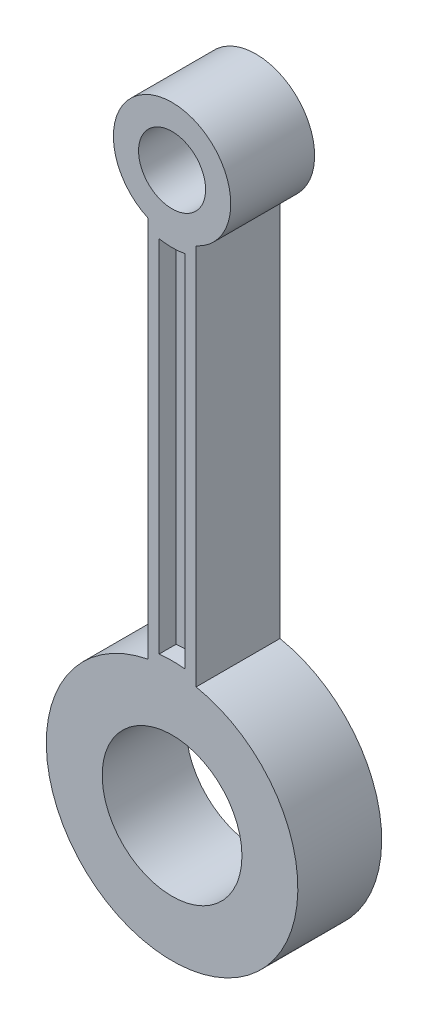
ISO-10303-21;
HEADER;
FILE_DESCRIPTION(('STEP AP214'),'2;1');
FILE_NAME('part.step','',(''),(''),'','','');
FILE_SCHEMA(('AUTOMOTIVE_DESIGN { 1 0 10303 214 1 1 1 1 }'));
ENDSEC;
DATA;
#1=APPLICATION_CONTEXT('core data for automotive mechanical design processes');
#2=APPLICATION_PROTOCOL_DEFINITION('international standard','automotive_design',2000,#1);
#3=PRODUCT_CONTEXT('',#1,'mechanical');
#4=PRODUCT('Part','Part','',(#3));
#5=PRODUCT_RELATED_PRODUCT_CATEGORY('part','',(#4));
#6=PRODUCT_DEFINITION_FORMATION('','',#4);
#7=PRODUCT_DEFINITION_CONTEXT('part definition',#1,'design');
#8=PRODUCT_DEFINITION('design','',#6,#7);
#9=PRODUCT_DEFINITION_SHAPE('','',#8);
#10=(LENGTH_UNIT() NAMED_UNIT(*) SI_UNIT(.MILLI.,.METRE.));
#11=(NAMED_UNIT(*) PLANE_ANGLE_UNIT() SI_UNIT($,.RADIAN.));
#12=(NAMED_UNIT(*) SI_UNIT($,.STERADIAN.) SOLID_ANGLE_UNIT());
#13=UNCERTAINTY_MEASURE_WITH_UNIT(LENGTH_MEASURE(1.E-05),#10,'distance_accuracy_value','');
#14=(GEOMETRIC_REPRESENTATION_CONTEXT(3) GLOBAL_UNCERTAINTY_ASSIGNED_CONTEXT((#13)) GLOBAL_UNIT_ASSIGNED_CONTEXT((#10,
#11,#12)) REPRESENTATION_CONTEXT('',''));
#15=CARTESIAN_POINT('',(0.,0.,0.));
#16=DIRECTION('',(0.,0.,1.));
#17=DIRECTION('',(1.,0.,0.));
#18=AXIS2_PLACEMENT_3D('',#15,#16,#17);
#19=CARTESIAN_POINT('',(-2.28940693972808,-31.4618055569592,7.5));
#20=DIRECTION('',(0.,0.,-1.));
#21=DIRECTION('',(-1.,0.,0.));
#22=AXIS2_PLACEMENT_3D('',#19,#20,#21);
#23=CYLINDRICAL_SURFACE('',#22,24.);
#24=DIRECTION('',(0.,0.,-1.));
#25=VECTOR('',#24,1.);
#26=CARTESIAN_POINT('',(-4.5894069397281,-7.57226809806313,7.5));
#27=LINE('',#26,#25);
#28=CARTESIAN_POINT('',(-4.5894069397281,-7.57226809806313,-4.5));
#29=VERTEX_POINT('',#28);
#30=CARTESIAN_POINT('',(-4.5894069397281,-7.57226809806313,-7.5));
#31=VERTEX_POINT('',#30);
#32=EDGE_CURVE('E137',#29,#31,#27,.T.);
#33=ORIENTED_EDGE('',*,*,#32,.F.);
#34=CARTESIAN_POINT('',(-2.28940693972808,-31.4618055569592,-4.5));
#35=DIRECTION('',(0.,0.,-1.));
#36=DIRECTION('',(1.,0.,0.));
#37=AXIS2_PLACEMENT_3D('',#34,#35,#36);
#38=CIRCLE('',#37,24.);
#39=CARTESIAN_POINT('',(0.0105930602718988,-7.57226809806313,-4.5));
#40=VERTEX_POINT('',#39);
#41=EDGE_CURVE('E155',#29,#40,#38,.T.);
#42=ORIENTED_EDGE('',*,*,#41,.T.);
#43=DIRECTION('',(0.,0.,-1.));
#44=VECTOR('',#43,1.);
#45=CARTESIAN_POINT('',(0.0105930602718988,-7.57226809806313,7.5));
#46=LINE('',#45,#44);
#47=CARTESIAN_POINT('',(0.0105930602718988,-7.57226809806313,-7.5));
#48=VERTEX_POINT('',#47);
#49=EDGE_CURVE('E187',#40,#48,#46,.T.);
#50=ORIENTED_EDGE('',*,*,#49,.T.);
#51=CARTESIAN_POINT('',(-2.28940693972808,-31.4618055569592,-7.5));
#52=DIRECTION('',(0.,0.,-1.));
#53=DIRECTION('',(1.,0.,0.));
#54=AXIS2_PLACEMENT_3D('',#51,#52,#53);
#55=CIRCLE('',#54,24.);
#56=EDGE_CURVE('E147',#31,#48,#55,.T.);
#57=ORIENTED_EDGE('',*,*,#56,.F.);
#58=EDGE_LOOP('',(#33,#42,#50,#57));
#59=FACE_BOUND('',#58,.T.);
#60=ADVANCED_FACE('F36',(#59),#23,.T.);
#61=CARTESIAN_POINT('',(0.0105930602718988,-7.57226809806313,7.5));
#62=DIRECTION('',(-1.,0.,0.));
#63=DIRECTION('',(0.,-1.,0.));
#64=AXIS2_PLACEMENT_3D('',#61,#62,#63);
#65=PLANE('',#64);
#66=ORIENTED_EDGE('',*,*,#49,.F.);
#67=DIRECTION('',(0.,1.,0.));
#68=VECTOR('',#67,1.);
#69=CARTESIAN_POINT('',(0.0105930602718988,-7.57226809806313,-4.5));
#70=LINE('',#69,#68);
#71=CARTESIAN_POINT('',(0.010593060271891,56.7606734814801,-4.5));
#72=VERTEX_POINT('',#71);
#73=EDGE_CURVE('E158',#40,#72,#70,.T.);
#74=ORIENTED_EDGE('',*,*,#73,.T.);
#75=DIRECTION('',(0.,0.,-1.));
#76=VECTOR('',#75,1.);
#77=CARTESIAN_POINT('',(0.010593060271891,56.7606734814801,7.5));
#78=LINE('',#77,#76);
#79=CARTESIAN_POINT('',(0.010593060271891,56.7606734814801,-7.5));
#80=VERTEX_POINT('',#79);
#81=EDGE_CURVE('E184',#72,#80,#78,.T.);
#82=ORIENTED_EDGE('',*,*,#81,.T.);
#83=DIRECTION('',(0.,1.,0.));
#84=VECTOR('',#83,1.);
#85=CARTESIAN_POINT('',(0.0105930602718988,-7.57226809806313,-7.5));
#86=LINE('',#85,#84);
#87=EDGE_CURVE('E150',#48,#80,#86,.T.);
#88=ORIENTED_EDGE('',*,*,#87,.F.);
#89=EDGE_LOOP('',(#66,#74,#82,#88));
#90=FACE_BOUND('',#89,.T.);
#91=ADVANCED_FACE('F255',(#90),#65,.T.);
#92=CARTESIAN_POINT('',(-2.2894069397281,68.5381944430408,7.5));
#93=DIRECTION('',(0.,0.,-1.));
#94=DIRECTION('',(-1.,0.,0.));
#95=AXIS2_PLACEMENT_3D('',#92,#93,#94);
#96=CYLINDRICAL_SURFACE('',#95,12.);
#97=ORIENTED_EDGE('',*,*,#81,.F.);
#98=CARTESIAN_POINT('',(-2.2894069397281,68.5381944430408,-4.5));
#99=DIRECTION('',(0.,0.,-1.));
#100=DIRECTION('',(1.,0.,0.));
#101=AXIS2_PLACEMENT_3D('',#98,#99,#100);
#102=CIRCLE('',#101,12.);
#103=CARTESIAN_POINT('',(-4.5894069397281,56.7606734814801,-4.5));
#104=VERTEX_POINT('',#103);
#105=EDGE_CURVE('E161',#72,#104,#102,.T.);
#106=ORIENTED_EDGE('',*,*,#105,.T.);
#107=DIRECTION('',(0.,0.,-1.));
#108=VECTOR('',#107,1.);
#109=CARTESIAN_POINT('',(-4.5894069397281,56.7606734814801,7.5));
#110=LINE('',#109,#108);
#111=CARTESIAN_POINT('',(-4.5894069397281,56.7606734814801,-7.5));
#112=VERTEX_POINT('',#111);
#113=EDGE_CURVE('E136',#104,#112,#110,.T.);
#114=ORIENTED_EDGE('',*,*,#113,.T.);
#115=CARTESIAN_POINT('',(-2.2894069397281,68.5381944430408,-7.5));
#116=DIRECTION('',(0.,0.,-1.));
#117=DIRECTION('',(1.,0.,0.));
#118=AXIS2_PLACEMENT_3D('',#115,#116,#117);
#119=CIRCLE('',#118,12.);
#120=EDGE_CURVE('E177',#80,#112,#119,.T.);
#121=ORIENTED_EDGE('',*,*,#120,.F.);
#122=EDGE_LOOP('',(#97,#106,#114,#121));
#123=FACE_BOUND('',#122,.T.);
#124=ADVANCED_FACE('F261',(#123),#96,.T.);
#125=CARTESIAN_POINT('',(-4.58940693972811,56.7606734814801,7.5));
#126=DIRECTION('',(1.,0.,0.));
#127=DIRECTION('',(0.,1.,0.));
#128=AXIS2_PLACEMENT_3D('',#125,#126,#127);
#129=PLANE('',#128);
#130=ORIENTED_EDGE('',*,*,#113,.F.);
#131=DIRECTION('',(0.,-1.,0.));
#132=VECTOR('',#131,1.);
#133=CARTESIAN_POINT('',(-4.5894069397281,56.7606734814801,-4.5));
#134=LINE('',#133,#132);
#135=EDGE_CURVE('E144',#104,#29,#134,.T.);
#136=ORIENTED_EDGE('',*,*,#135,.T.);
#137=ORIENTED_EDGE('',*,*,#32,.T.);
#138=DIRECTION('',(0.,-1.,0.));
#139=VECTOR('',#138,1.);
#140=CARTESIAN_POINT('',(-4.58940693972811,56.7606734814801,-7.5));
#141=LINE('',#140,#139);
#142=EDGE_CURVE('E169',#112,#31,#141,.T.);
#143=ORIENTED_EDGE('',*,*,#142,.F.);
#144=EDGE_LOOP('',(#130,#136,#137,#143));
#145=FACE_BOUND('',#144,.T.);
#146=ADVANCED_FACE('F285',(#145),#129,.T.);
#147=CARTESIAN_POINT('',(-2.28940693972808,-31.4618055569592,7.5));
#148=DIRECTION('',(0.,0.,1.));
#149=DIRECTION('',(1.,0.,0.));
#150=AXIS2_PLACEMENT_3D('',#147,#148,#149);
#151=PLANE('',#150);
#152=CARTESIAN_POINT('',(-2.28940693972808,-31.4618055569592,7.5));
#153=DIRECTION('',(0.,0.,1.));
#154=DIRECTION('',(1.,0.,0.));
#155=AXIS2_PLACEMENT_3D('',#152,#153,#154);
#156=CIRCLE('',#155,12.5);
#157=CARTESIAN_POINT('',(10.2105930602719,-31.4618055569592,7.5));
#158=VERTEX_POINT('',#157);
#159=EDGE_CURVE('E196',#158,#158,#156,.T.);
#160=ORIENTED_EDGE('',*,*,#159,.F.);
#161=EDGE_LOOP('',(#160));
#162=FACE_BOUND('',#161,.T.);
#163=CARTESIAN_POINT('',(-2.28940693972808,-31.4618055569592,7.5));
#164=DIRECTION('',(0.,0.,1.));
#165=DIRECTION('',(1.,0.,0.));
#166=AXIS2_PLACEMENT_3D('',#163,#164,#165);
#167=CIRCLE('',#166,22.5);
#168=CARTESIAN_POINT('',(-6.5894069397281,-9.37651633539822,7.5));
#169=VERTEX_POINT('',#168);
#170=CARTESIAN_POINT('',(2.0105930602719,-9.37651633539822,7.5));
#171=VERTEX_POINT('',#170);
#172=EDGE_CURVE('E202',#169,#171,#167,.T.);
#173=ORIENTED_EDGE('',*,*,#172,.T.);
#174=DIRECTION('',(0.,1.,0.));
#175=VECTOR('',#174,1.);
#176=CARTESIAN_POINT('',(2.0105930602719,-9.37651633539822,7.5));
#177=LINE('',#176,#175);
#178=CARTESIAN_POINT('',(2.01059306027189,58.9590504311783,7.5));
#179=VERTEX_POINT('',#178);
#180=EDGE_CURVE('E205',#171,#179,#177,.T.);
#181=ORIENTED_EDGE('',*,*,#180,.T.);
#182=CARTESIAN_POINT('',(-2.2894069397281,68.5381944430408,7.5));
#183=DIRECTION('',(0.,0.,1.));
#184=DIRECTION('',(1.,0.,0.));
#185=AXIS2_PLACEMENT_3D('',#182,#183,#184);
#186=CIRCLE('',#185,10.5);
#187=CARTESIAN_POINT('',(-6.58940693972809,58.9590504311783,7.5));
#188=VERTEX_POINT('',#187);
#189=EDGE_CURVE('E208',#179,#188,#186,.T.);
#190=ORIENTED_EDGE('',*,*,#189,.T.);
#191=DIRECTION('',(0.,-1.,0.));
#192=VECTOR('',#191,1.);
#193=CARTESIAN_POINT('',(-6.58940693972809,58.9590504311783,7.5));
#194=LINE('',#193,#192);
#195=EDGE_CURVE('E210',#188,#169,#194,.T.);
#196=ORIENTED_EDGE('',*,*,#195,.T.);
#197=EDGE_LOOP('',(#173,#181,#190,#196));
#198=FACE_BOUND('',#197,.T.);
#199=CARTESIAN_POINT('',(-2.2894069397281,68.5381944430408,7.5));
#200=DIRECTION('',(0.,0.,1.));
#201=DIRECTION('',(1.,0.,0.));
#202=AXIS2_PLACEMENT_3D('',#199,#200,#201);
#203=CIRCLE('',#202,6.);
#204=CARTESIAN_POINT('',(3.71059306027191,68.5381944430408,7.5));
#205=VERTEX_POINT('',#204);
#206=EDGE_CURVE('E190',#205,#205,#203,.T.);
#207=ORIENTED_EDGE('',*,*,#206,.F.);
#208=EDGE_LOOP('',(#207));
#209=FACE_BOUND('',#208,.T.);
#210=DIRECTION('',(0.,1.,0.));
#211=VECTOR('',#210,1.);
#212=CARTESIAN_POINT('',(0.0105930602718988,-7.57226809806313,7.5));
#213=LINE('',#212,#211);
#214=CARTESIAN_POINT('',(0.0105930602718988,-7.57226809806313,7.5));
#215=VERTEX_POINT('',#214);
#216=CARTESIAN_POINT('',(0.010593060271891,56.7606734814801,7.5));
#217=VERTEX_POINT('',#216);
#218=EDGE_CURVE('E168',#215,#217,#213,.T.);
#219=ORIENTED_EDGE('',*,*,#218,.F.);
#220=CARTESIAN_POINT('',(-2.28940693972808,-31.4618055569592,7.5));
#221=DIRECTION('',(0.,0.,-1.));
#222=DIRECTION('',(1.,0.,0.));
#223=AXIS2_PLACEMENT_3D('',#220,#221,#222);
#224=CIRCLE('',#223,24.);
#225=CARTESIAN_POINT('',(-4.5894069397281,-7.57226809806313,7.5));
#226=VERTEX_POINT('',#225);
#227=EDGE_CURVE('E166',#226,#215,#224,.T.);
#228=ORIENTED_EDGE('',*,*,#227,.F.);
#229=DIRECTION('',(0.,-1.,0.));
#230=VECTOR('',#229,1.);
#231=CARTESIAN_POINT('',(-4.58940693972811,56.7606734814801,7.5));
#232=LINE('',#231,#230);
#233=CARTESIAN_POINT('',(-4.58940693972811,56.7606734814801,7.5));
#234=VERTEX_POINT('',#233);
#235=EDGE_CURVE('E133',#234,#226,#232,.T.);
#236=ORIENTED_EDGE('',*,*,#235,.F.);
#237=CARTESIAN_POINT('',(-2.2894069397281,68.5381944430408,7.5));
#238=DIRECTION('',(0.,0.,-1.));
#239=DIRECTION('',(1.,0.,0.));
#240=AXIS2_PLACEMENT_3D('',#237,#238,#239);
#241=CIRCLE('',#240,12.);
#242=EDGE_CURVE('E171',#217,#234,#241,.T.);
#243=ORIENTED_EDGE('',*,*,#242,.F.);
#244=EDGE_LOOP('',(#219,#228,#236,#243));
#245=FACE_BOUND('',#244,.T.);
#246=ADVANCED_FACE('F245',(#162,#198,#209,#245),#151,.T.);
#247=CARTESIAN_POINT('',(-2.28940693972808,-31.4618055569592,-7.5));
#248=DIRECTION('',(0.,0.,1.));
#249=DIRECTION('',(1.,0.,0.));
#250=AXIS2_PLACEMENT_3D('',#247,#248,#249);
#251=PLANE('',#250);
#252=CARTESIAN_POINT('',(-2.2894069397281,68.5381944430408,-7.5));
#253=DIRECTION('',(0.,0.,1.));
#254=DIRECTION('',(1.,0.,0.));
#255=AXIS2_PLACEMENT_3D('',#252,#253,#254);
#256=CIRCLE('',#255,6.);
#257=CARTESIAN_POINT('',(3.71059306027191,68.5381944430408,-7.5));
#258=VERTEX_POINT('',#257);
#259=EDGE_CURVE('E189',#258,#258,#256,.T.);
#260=ORIENTED_EDGE('',*,*,#259,.T.);
#261=EDGE_LOOP('',(#260));
#262=FACE_BOUND('',#261,.T.);
#263=CARTESIAN_POINT('',(-2.28940693972808,-31.4618055569592,-7.5));
#264=DIRECTION('',(0.,0.,1.));
#265=DIRECTION('',(1.,0.,0.));
#266=AXIS2_PLACEMENT_3D('',#263,#264,#265);
#267=CIRCLE('',#266,12.5);
#268=CARTESIAN_POINT('',(10.2105930602719,-31.4618055569592,-7.5));
#269=VERTEX_POINT('',#268);
#270=EDGE_CURVE('E193',#269,#269,#267,.T.);
#271=ORIENTED_EDGE('',*,*,#270,.T.);
#272=EDGE_LOOP('',(#271));
#273=FACE_BOUND('',#272,.T.);
#274=CARTESIAN_POINT('',(-2.28940693972808,-31.4618055569592,-7.5));
#275=DIRECTION('',(0.,0.,1.));
#276=DIRECTION('',(1.,0.,0.));
#277=AXIS2_PLACEMENT_3D('',#274,#275,#276);
#278=CIRCLE('',#277,22.5);
#279=CARTESIAN_POINT('',(-6.5894069397281,-9.37651633539822,-7.5));
#280=VERTEX_POINT('',#279);
#281=CARTESIAN_POINT('',(2.0105930602719,-9.37651633539822,-7.5));
#282=VERTEX_POINT('',#281);
#283=EDGE_CURVE('E199',#280,#282,#278,.T.);
#284=ORIENTED_EDGE('',*,*,#283,.F.);
#285=DIRECTION('',(0.,-1.,0.));
#286=VECTOR('',#285,1.);
#287=CARTESIAN_POINT('',(-6.58940693972809,58.9590504311783,-7.5));
#288=LINE('',#287,#286);
#289=CARTESIAN_POINT('',(-6.58940693972809,58.9590504311783,-7.5));
#290=VERTEX_POINT('',#289);
#291=EDGE_CURVE('E206',#290,#280,#288,.T.);
#292=ORIENTED_EDGE('',*,*,#291,.F.);
#293=CARTESIAN_POINT('',(-2.2894069397281,68.5381944430408,-7.5));
#294=DIRECTION('',(0.,0.,1.));
#295=DIRECTION('',(1.,0.,0.));
#296=AXIS2_PLACEMENT_3D('',#293,#294,#295);
#297=CIRCLE('',#296,10.5);
#298=CARTESIAN_POINT('',(2.01059306027189,58.9590504311783,-7.5));
#299=VERTEX_POINT('',#298);
#300=EDGE_CURVE('E217',#299,#290,#297,.T.);
#301=ORIENTED_EDGE('',*,*,#300,.F.);
#302=DIRECTION('',(0.,1.,0.));
#303=VECTOR('',#302,1.);
#304=CARTESIAN_POINT('',(2.0105930602719,-9.37651633539822,-7.5));
#305=LINE('',#304,#303);
#306=EDGE_CURVE('E215',#282,#299,#305,.T.);
#307=ORIENTED_EDGE('',*,*,#306,.F.);
#308=EDGE_LOOP('',(#284,#292,#301,#307));
#309=FACE_BOUND('',#308,.T.);
#310=ORIENTED_EDGE('',*,*,#56,.T.);
#311=ORIENTED_EDGE('',*,*,#87,.T.);
#312=ORIENTED_EDGE('',*,*,#120,.T.);
#313=ORIENTED_EDGE('',*,*,#142,.T.);
#314=EDGE_LOOP('',(#310,#311,#312,#313));
#315=FACE_BOUND('',#314,.T.);
#316=ADVANCED_FACE('F235',(#262,#273,#309,#315),#251,.F.);
#317=CARTESIAN_POINT('',(-2.28940693972808,-31.4618055569592,7.5));
#318=DIRECTION('',(0.,0.,-1.));
#319=DIRECTION('',(-1.,0.,0.));
#320=AXIS2_PLACEMENT_3D('',#317,#318,#319);
#321=CYLINDRICAL_SURFACE('',#320,22.5);
#322=ORIENTED_EDGE('',*,*,#283,.T.);
#323=DIRECTION('',(0.,0.,-1.));
#324=VECTOR('',#323,1.);
#325=CARTESIAN_POINT('',(2.0105930602719,-9.37651633539822,7.5));
#326=LINE('',#325,#324);
#327=EDGE_CURVE('E11',#171,#282,#326,.T.);
#328=ORIENTED_EDGE('',*,*,#327,.F.);
#329=ORIENTED_EDGE('',*,*,#172,.F.);
#330=DIRECTION('',(0.,0.,-1.));
#331=VECTOR('',#330,1.);
#332=CARTESIAN_POINT('',(-6.5894069397281,-9.37651633539822,7.5));
#333=LINE('',#332,#331);
#334=EDGE_CURVE('E212',#169,#280,#333,.T.);
#335=ORIENTED_EDGE('',*,*,#334,.T.);
#336=EDGE_LOOP('',(#322,#328,#329,#335));
#337=FACE_BOUND('',#336,.T.);
#338=ADVANCED_FACE('F38',(#337),#321,.T.);
#339=CARTESIAN_POINT('',(2.0105930602719,-9.37651633539822,7.5));
#340=DIRECTION('',(-1.,0.,0.));
#341=DIRECTION('',(0.,-1.,0.));
#342=AXIS2_PLACEMENT_3D('',#339,#340,#341);
#343=PLANE('',#342);
#344=ORIENTED_EDGE('',*,*,#306,.T.);
#345=DIRECTION('',(0.,0.,-1.));
#346=VECTOR('',#345,1.);
#347=CARTESIAN_POINT('',(2.01059306027189,58.9590504311783,7.5));
#348=LINE('',#347,#346);
#349=EDGE_CURVE('E44',#179,#299,#348,.T.);
#350=ORIENTED_EDGE('',*,*,#349,.F.);
#351=ORIENTED_EDGE('',*,*,#180,.F.);
#352=ORIENTED_EDGE('',*,*,#327,.T.);
#353=EDGE_LOOP('',(#344,#350,#351,#352));
#354=FACE_BOUND('',#353,.T.);
#355=ADVANCED_FACE('F247',(#354),#343,.F.);
#356=CARTESIAN_POINT('',(-2.2894069397281,68.5381944430408,7.5));
#357=DIRECTION('',(0.,0.,-1.));
#358=DIRECTION('',(-1.,0.,0.));
#359=AXIS2_PLACEMENT_3D('',#356,#357,#358);
#360=CYLINDRICAL_SURFACE('',#359,10.5);
#361=ORIENTED_EDGE('',*,*,#300,.T.);
#362=DIRECTION('',(0.,0.,-1.));
#363=VECTOR('',#362,1.);
#364=CARTESIAN_POINT('',(-6.58940693972809,58.9590504311783,7.5));
#365=LINE('',#364,#363);
#366=EDGE_CURVE('E222',#188,#290,#365,.T.);
#367=ORIENTED_EDGE('',*,*,#366,.F.);
#368=ORIENTED_EDGE('',*,*,#189,.F.);
#369=ORIENTED_EDGE('',*,*,#349,.T.);
#370=EDGE_LOOP('',(#361,#367,#368,#369));
#371=FACE_BOUND('',#370,.T.);
#372=ADVANCED_FACE('F229',(#371),#360,.T.);
#373=CARTESIAN_POINT('',(-6.58940693972809,58.9590504311783,7.5));
#374=DIRECTION('',(1.,0.,0.));
#375=DIRECTION('',(0.,1.,0.));
#376=AXIS2_PLACEMENT_3D('',#373,#374,#375);
#377=PLANE('',#376);
#378=ORIENTED_EDGE('',*,*,#291,.T.);
#379=ORIENTED_EDGE('',*,*,#334,.F.);
#380=ORIENTED_EDGE('',*,*,#195,.F.);
#381=ORIENTED_EDGE('',*,*,#366,.T.);
#382=EDGE_LOOP('',(#378,#379,#380,#381));
#383=FACE_BOUND('',#382,.T.);
#384=ADVANCED_FACE('F239',(#383),#377,.F.);
#385=CARTESIAN_POINT('',(-2.28940693972808,-31.4618055569592,7.5));
#386=DIRECTION('',(0.,0.,-1.));
#387=DIRECTION('',(-1.,0.,0.));
#388=AXIS2_PLACEMENT_3D('',#385,#386,#387);
#389=CYLINDRICAL_SURFACE('',#388,12.5);
#390=ORIENTED_EDGE('',*,*,#159,.T.);
#391=EDGE_LOOP('',(#390));
#392=FACE_BOUND('',#391,.T.);
#393=ORIENTED_EDGE('',*,*,#270,.F.);
#394=EDGE_LOOP('',(#393));
#395=FACE_BOUND('',#394,.T.);
#396=ADVANCED_FACE('F274',(#392,#395),#389,.F.);
#397=CARTESIAN_POINT('',(-2.2894069397281,68.5381944430408,7.5));
#398=DIRECTION('',(0.,0.,-1.));
#399=DIRECTION('',(-1.,0.,0.));
#400=AXIS2_PLACEMENT_3D('',#397,#398,#399);
#401=CYLINDRICAL_SURFACE('',#400,6.);
#402=ORIENTED_EDGE('',*,*,#206,.T.);
#403=EDGE_LOOP('',(#402));
#404=FACE_BOUND('',#403,.T.);
#405=ORIENTED_EDGE('',*,*,#259,.F.);
#406=EDGE_LOOP('',(#405));
#407=FACE_BOUND('',#406,.T.);
#408=ADVANCED_FACE('F268',(#404,#407),#401,.F.);
#409=CARTESIAN_POINT('',(-2.28940693972808,-31.4618055569592,4.5));
#410=DIRECTION('',(0.,0.,-1.));
#411=DIRECTION('',(1.,0.,0.));
#412=AXIS2_PLACEMENT_3D('',#409,#410,#411);
#413=CIRCLE('',#412,24.);
#414=CARTESIAN_POINT('',(-4.5894069397281,-7.57226809806313,4.5));
#415=VERTEX_POINT('',#414);
#416=CARTESIAN_POINT('',(0.0105930602718988,-7.57226809806313,4.5));
#417=VERTEX_POINT('',#416);
#418=EDGE_CURVE('E140',#415,#417,#413,.T.);
#419=ORIENTED_EDGE('',*,*,#418,.F.);
#420=EDGE_CURVE('E127',#226,#415,#27,.T.);
#421=ORIENTED_EDGE('',*,*,#420,.F.);
#422=ORIENTED_EDGE('',*,*,#227,.T.);
#423=EDGE_CURVE('E142',#215,#417,#46,.T.);
#424=ORIENTED_EDGE('',*,*,#423,.T.);
#425=EDGE_LOOP('',(#419,#421,#422,#424));
#426=FACE_BOUND('',#425,.T.);
#427=ADVANCED_FACE('F141',(#426),#23,.T.);
#428=DIRECTION('',(0.,1.,0.));
#429=VECTOR('',#428,1.);
#430=CARTESIAN_POINT('',(0.0105930602718988,-7.57226809806313,4.5));
#431=LINE('',#430,#429);
#432=CARTESIAN_POINT('',(0.010593060271891,56.7606734814801,4.5));
#433=VERTEX_POINT('',#432);
#434=EDGE_CURVE('E51',#417,#433,#431,.T.);
#435=ORIENTED_EDGE('',*,*,#434,.F.);
#436=ORIENTED_EDGE('',*,*,#423,.F.);
#437=ORIENTED_EDGE('',*,*,#218,.T.);
#438=EDGE_CURVE('E185',#217,#433,#78,.T.);
#439=ORIENTED_EDGE('',*,*,#438,.T.);
#440=EDGE_LOOP('',(#435,#436,#437,#439));
#441=FACE_BOUND('',#440,.T.);
#442=ADVANCED_FACE('F264',(#441),#65,.T.);
#443=CARTESIAN_POINT('',(-2.2894069397281,68.5381944430408,4.5));
#444=DIRECTION('',(0.,0.,-1.));
#445=DIRECTION('',(1.,0.,0.));
#446=AXIS2_PLACEMENT_3D('',#443,#444,#445);
#447=CIRCLE('',#446,12.);
#448=CARTESIAN_POINT('',(-4.5894069397281,56.7606734814801,4.5));
#449=VERTEX_POINT('',#448);
#450=EDGE_CURVE('E59',#433,#449,#447,.T.);
#451=ORIENTED_EDGE('',*,*,#450,.F.);
#452=ORIENTED_EDGE('',*,*,#438,.F.);
#453=ORIENTED_EDGE('',*,*,#242,.T.);
#454=EDGE_CURVE('E182',#234,#449,#110,.T.);
#455=ORIENTED_EDGE('',*,*,#454,.T.);
#456=EDGE_LOOP('',(#451,#452,#453,#455));
#457=FACE_BOUND('',#456,.T.);
#458=ADVANCED_FACE('F273',(#457),#96,.T.);
#459=DIRECTION('',(0.,-1.,0.));
#460=VECTOR('',#459,1.);
#461=CARTESIAN_POINT('',(-4.5894069397281,56.7606734814801,4.5));
#462=LINE('',#461,#460);
#463=EDGE_CURVE('E131',#449,#415,#462,.T.);
#464=ORIENTED_EDGE('',*,*,#463,.F.);
#465=ORIENTED_EDGE('',*,*,#454,.F.);
#466=ORIENTED_EDGE('',*,*,#235,.T.);
#467=ORIENTED_EDGE('',*,*,#420,.T.);
#468=EDGE_LOOP('',(#464,#465,#466,#467));
#469=FACE_BOUND('',#468,.T.);
#470=ADVANCED_FACE('F129',(#469),#129,.T.);
#471=CARTESIAN_POINT('',(-2.28940693972808,-31.4618055569592,-4.5));
#472=DIRECTION('',(0.,0.,1.));
#473=DIRECTION('',(1.,0.,0.));
#474=AXIS2_PLACEMENT_3D('',#471,#472,#473);
#475=PLANE('',#474);
#476=ORIENTED_EDGE('',*,*,#41,.F.);
#477=ORIENTED_EDGE('',*,*,#135,.F.);
#478=ORIENTED_EDGE('',*,*,#105,.F.);
#479=ORIENTED_EDGE('',*,*,#73,.F.);
#480=EDGE_LOOP('',(#476,#477,#478,#479));
#481=FACE_BOUND('',#480,.T.);
#482=ADVANCED_FACE('F358',(#481),#475,.F.);
#483=CARTESIAN_POINT('',(-2.28940693972808,-31.4618055569592,4.5));
#484=DIRECTION('',(0.,0.,1.));
#485=DIRECTION('',(1.,0.,0.));
#486=AXIS2_PLACEMENT_3D('',#483,#484,#485);
#487=PLANE('',#486);
#488=ORIENTED_EDGE('',*,*,#418,.T.);
#489=ORIENTED_EDGE('',*,*,#434,.T.);
#490=ORIENTED_EDGE('',*,*,#450,.T.);
#491=ORIENTED_EDGE('',*,*,#463,.T.);
#492=EDGE_LOOP('',(#488,#489,#490,#491));
#493=FACE_BOUND('',#492,.T.);
#494=ADVANCED_FACE('F146',(#493),#487,.T.);
#495=CLOSED_SHELL('',(#60,#91,#124,#146,#246,#316,#338,#355,#372,#384,#396,#408,#427,#442,#458,
#470,#482,#494));
#496=MANIFOLD_SOLID_BREP('B2',#495);
#497=ADVANCED_BREP_SHAPE_REPRESENTATION('',(#18,#496),#14);
#498=SHAPE_DEFINITION_REPRESENTATION(#9,#497);
ENDSEC;
END-ISO-10303-21;
